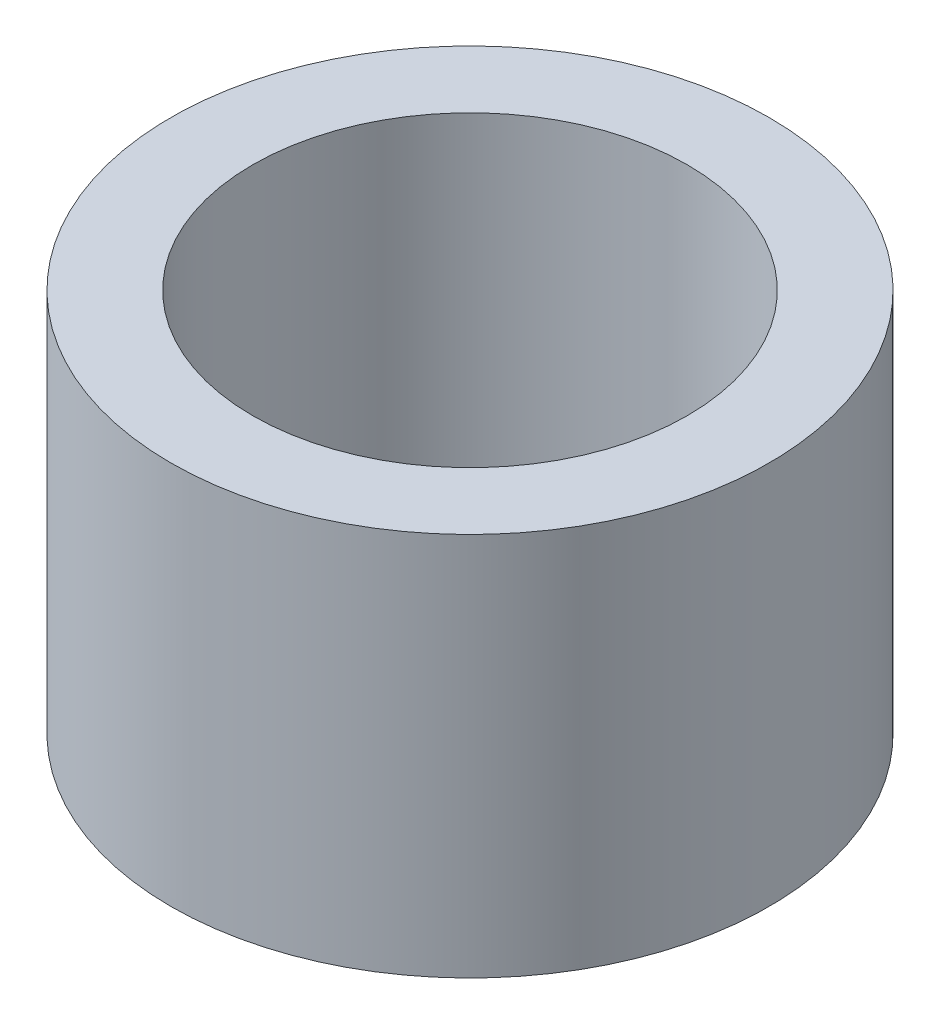
ISO-10303-21;
HEADER;
FILE_DESCRIPTION(('STEP AP214'),'2;1');
FILE_NAME('part.step','',(''),(''),'','','');
FILE_SCHEMA(('AUTOMOTIVE_DESIGN { 1 0 10303 214 1 1 1 1 }'));
ENDSEC;
DATA;
#1=APPLICATION_CONTEXT('core data for automotive mechanical design processes');
#2=APPLICATION_PROTOCOL_DEFINITION('international standard','automotive_design',2000,#1);
#3=PRODUCT_CONTEXT('',#1,'mechanical');
#4=PRODUCT('Part','Part','',(#3));
#5=PRODUCT_RELATED_PRODUCT_CATEGORY('part','',(#4));
#6=PRODUCT_DEFINITION_FORMATION('','',#4);
#7=PRODUCT_DEFINITION_CONTEXT('part definition',#1,'design');
#8=PRODUCT_DEFINITION('design','',#6,#7);
#9=PRODUCT_DEFINITION_SHAPE('','',#8);
#10=(LENGTH_UNIT() NAMED_UNIT(*) SI_UNIT(.MILLI.,.METRE.));
#11=(NAMED_UNIT(*) PLANE_ANGLE_UNIT() SI_UNIT($,.RADIAN.));
#12=(NAMED_UNIT(*) SI_UNIT($,.STERADIAN.) SOLID_ANGLE_UNIT());
#13=UNCERTAINTY_MEASURE_WITH_UNIT(LENGTH_MEASURE(1.E-05),#10,'distance_accuracy_value','');
#14=(GEOMETRIC_REPRESENTATION_CONTEXT(3) GLOBAL_UNCERTAINTY_ASSIGNED_CONTEXT((#13)) GLOBAL_UNIT_ASSIGNED_CONTEXT((#10,
#11,#12)) REPRESENTATION_CONTEXT('',''));
#15=CARTESIAN_POINT('',(0.,0.,0.));
#16=DIRECTION('',(0.,0.,1.));
#17=DIRECTION('',(1.,0.,0.));
#18=AXIS2_PLACEMENT_3D('',#15,#16,#17);
#19=CARTESIAN_POINT('',(0.,7.98,0.));
#20=DIRECTION('',(0.,1.,0.));
#21=DIRECTION('',(0.,0.,1.));
#22=AXIS2_PLACEMENT_3D('',#19,#20,#21);
#23=PLANE('',#22);
#24=CARTESIAN_POINT('',(0.,7.98,0.));
#25=DIRECTION('',(0.,1.,0.));
#26=DIRECTION('',(0.,0.,1.));
#27=AXIS2_PLACEMENT_3D('',#24,#25,#26);
#28=CIRCLE('',#27,6.215);
#29=CARTESIAN_POINT('',(0.,7.98,6.215));
#30=VERTEX_POINT('',#29);
#31=EDGE_CURVE('E10',#30,#30,#28,.T.);
#32=ORIENTED_EDGE('',*,*,#31,.T.);
#33=EDGE_LOOP('',(#32));
#34=FACE_BOUND('',#33,.T.);
#35=CARTESIAN_POINT('',(0.,7.98,0.));
#36=DIRECTION('',(0.,1.,0.));
#37=DIRECTION('',(0.,0.,1.));
#38=AXIS2_PLACEMENT_3D('',#35,#36,#37);
#39=CIRCLE('',#38,4.515);
#40=CARTESIAN_POINT('',(0.,7.98,4.515));
#41=VERTEX_POINT('',#40);
#42=EDGE_CURVE('E44',#41,#41,#39,.T.);
#43=ORIENTED_EDGE('',*,*,#42,.F.);
#44=EDGE_LOOP('',(#43));
#45=FACE_BOUND('',#44,.T.);
#46=ADVANCED_FACE('F33',(#34,#45),#23,.T.);
#47=CARTESIAN_POINT('',(0.,0.,0.));
#48=DIRECTION('',(0.,1.,0.));
#49=DIRECTION('',(0.,0.,1.));
#50=AXIS2_PLACEMENT_3D('',#47,#48,#49);
#51=PLANE('',#50);
#52=CARTESIAN_POINT('',(0.,0.,0.));
#53=DIRECTION('',(0.,1.,0.));
#54=DIRECTION('',(0.,0.,1.));
#55=AXIS2_PLACEMENT_3D('',#52,#53,#54);
#56=CIRCLE('',#55,6.215);
#57=CARTESIAN_POINT('',(0.,0.,6.215));
#58=VERTEX_POINT('',#57);
#59=EDGE_CURVE('E37',#58,#58,#56,.T.);
#60=ORIENTED_EDGE('',*,*,#59,.F.);
#61=EDGE_LOOP('',(#60));
#62=FACE_BOUND('',#61,.T.);
#63=CARTESIAN_POINT('',(0.,0.,0.));
#64=DIRECTION('',(0.,1.,0.));
#65=DIRECTION('',(0.,0.,1.));
#66=AXIS2_PLACEMENT_3D('',#63,#64,#65);
#67=CIRCLE('',#66,4.515);
#68=CARTESIAN_POINT('',(0.,0.,4.515));
#69=VERTEX_POINT('',#68);
#70=EDGE_CURVE('E46',#69,#69,#67,.T.);
#71=ORIENTED_EDGE('',*,*,#70,.T.);
#72=EDGE_LOOP('',(#71));
#73=FACE_BOUND('',#72,.T.);
#74=ADVANCED_FACE('F56',(#62,#73),#51,.F.);
#75=CARTESIAN_POINT('',(0.,7.98,0.));
#76=DIRECTION('',(0.,-1.,0.));
#77=DIRECTION('',(0.,0.,-1.));
#78=AXIS2_PLACEMENT_3D('',#75,#76,#77);
#79=CYLINDRICAL_SURFACE('',#78,6.215);
#80=ORIENTED_EDGE('',*,*,#31,.F.);
#81=EDGE_LOOP('',(#80));
#82=FACE_BOUND('',#81,.T.);
#83=ORIENTED_EDGE('',*,*,#59,.T.);
#84=EDGE_LOOP('',(#83));
#85=FACE_BOUND('',#84,.T.);
#86=ADVANCED_FACE('F35',(#82,#85),#79,.T.);
#87=CARTESIAN_POINT('',(0.,7.98,0.));
#88=DIRECTION('',(0.,-1.,0.));
#89=DIRECTION('',(0.,0.,-1.));
#90=AXIS2_PLACEMENT_3D('',#87,#88,#89);
#91=CYLINDRICAL_SURFACE('',#90,4.515);
#92=ORIENTED_EDGE('',*,*,#42,.T.);
#93=EDGE_LOOP('',(#92));
#94=FACE_BOUND('',#93,.T.);
#95=ORIENTED_EDGE('',*,*,#70,.F.);
#96=EDGE_LOOP('',(#95));
#97=FACE_BOUND('',#96,.T.);
#98=ADVANCED_FACE('F52',(#94,#97),#91,.F.);
#99=CLOSED_SHELL('',(#46,#74,#86,#98));
#100=MANIFOLD_SOLID_BREP('B2',#99);
#101=ADVANCED_BREP_SHAPE_REPRESENTATION('',(#18,#100),#14);
#102=SHAPE_DEFINITION_REPRESENTATION(#9,#101);
ENDSEC;
END-ISO-10303-21;
